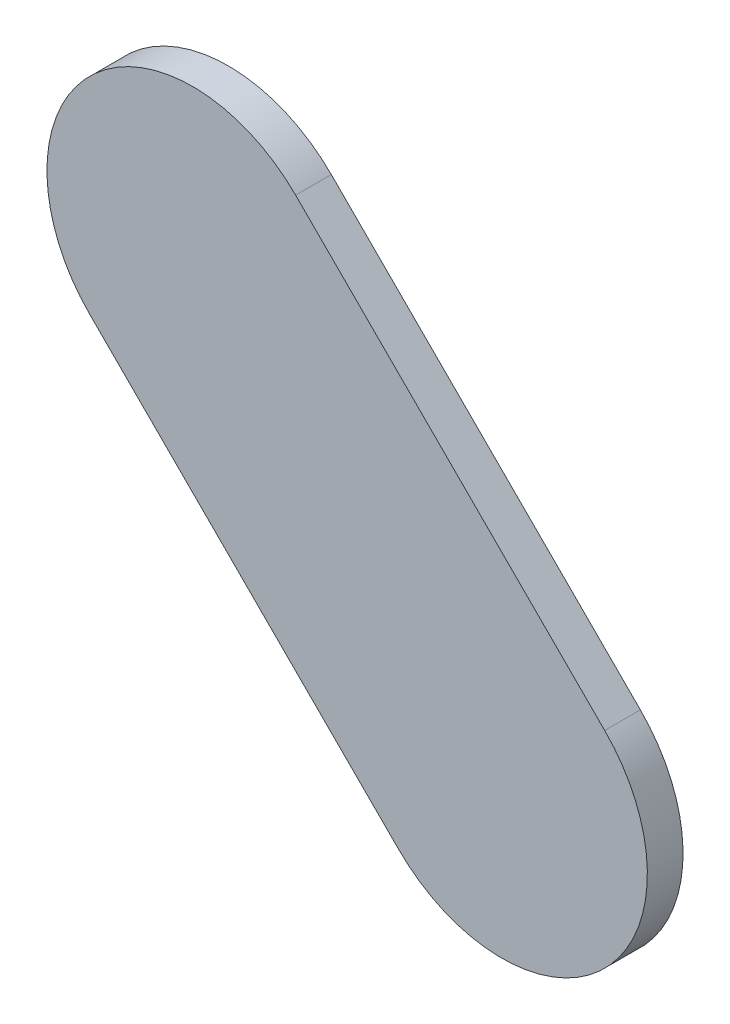
ISO-10303-21;
HEADER;
FILE_DESCRIPTION(('STEP AP214'),'2;1');
FILE_NAME('part.step','',(''),(''),'','','');
FILE_SCHEMA(('AUTOMOTIVE_DESIGN { 1 0 10303 214 1 1 1 1 }'));
ENDSEC;
DATA;
#1=APPLICATION_CONTEXT('core data for automotive mechanical design processes');
#2=APPLICATION_PROTOCOL_DEFINITION('international standard','automotive_design',2000,#1);
#3=PRODUCT_CONTEXT('',#1,'mechanical');
#4=PRODUCT('Part','Part','',(#3));
#5=PRODUCT_RELATED_PRODUCT_CATEGORY('part','',(#4));
#6=PRODUCT_DEFINITION_FORMATION('','',#4);
#7=PRODUCT_DEFINITION_CONTEXT('part definition',#1,'design');
#8=PRODUCT_DEFINITION('design','',#6,#7);
#9=PRODUCT_DEFINITION_SHAPE('','',#8);
#10=(LENGTH_UNIT() NAMED_UNIT(*) SI_UNIT(.MILLI.,.METRE.));
#11=(NAMED_UNIT(*) PLANE_ANGLE_UNIT() SI_UNIT($,.RADIAN.));
#12=(NAMED_UNIT(*) SI_UNIT($,.STERADIAN.) SOLID_ANGLE_UNIT());
#13=UNCERTAINTY_MEASURE_WITH_UNIT(LENGTH_MEASURE(1.E-05),#10,'distance_accuracy_value','');
#14=(GEOMETRIC_REPRESENTATION_CONTEXT(3) GLOBAL_UNCERTAINTY_ASSIGNED_CONTEXT((#13)) GLOBAL_UNIT_ASSIGNED_CONTEXT((#10,
#11,#12)) REPRESENTATION_CONTEXT('',''));
#15=CARTESIAN_POINT('',(0.,0.,0.));
#16=DIRECTION('',(0.,0.,1.));
#17=DIRECTION('',(1.,0.,0.));
#18=AXIS2_PLACEMENT_3D('',#15,#16,#17);
#19=CARTESIAN_POINT('',(4.079482332428,7.325038039131,0.79916));
#20=DIRECTION('',(0.,0.,1.));
#21=DIRECTION('',(1.,0.,0.));
#22=AXIS2_PLACEMENT_3D('',#19,#20,#21);
#23=PLANE('',#22);
#24=CARTESIAN_POINT('',(3.931096333,7.472904434268,0.79916));
#25=DIRECTION('',(0.,0.,1.));
#26=DIRECTION('',(1.,0.,0.));
#27=AXIS2_PLACEMENT_3D('',#24,#25,#26);
#28=CIRCLE('',#27,0.140000472348);
#29=CARTESIAN_POINT('',(3.83210122183356,7.3739094441665,0.79916));
#30=VERTEX_POINT('',#29);
#31=CARTESIAN_POINT('',(4.03009169726737,7.57189963673356,0.79916));
#32=VERTEX_POINT('',#31);
#33=EDGE_CURVE('E20',#30,#32,#28,.F.);
#34=ORIENTED_EDGE('',*,*,#33,.F.);
#35=DIRECTION('',(-0.707107575236102,0.707105987136102,0.));
#36=VECTOR('',#35,1.);
#37=CARTESIAN_POINT('',(4.129086333001,7.076925000001,0.79916));
#38=LINE('',#37,#36);
#39=CARTESIAN_POINT('',(4.12908641390159,7.07692491910059,0.79916));
#40=VERTEX_POINT('',#39);
#41=EDGE_CURVE('E65',#30,#40,#38,.F.);
#42=ORIENTED_EDGE('',*,*,#41,.T.);
#43=CARTESIAN_POINT('',(4.228081333,7.175919333,0.79916));
#44=DIRECTION('',(0.,0.,1.));
#45=DIRECTION('',(1.,0.,0.));
#46=AXIS2_PLACEMENT_3D('',#43,#44,#45);
#47=CIRCLE('',#46,0.140000072315);
#48=CARTESIAN_POINT('',(4.32707622233319,7.27491444466621,0.79916));
#49=VERTEX_POINT('',#48);
#50=EDGE_CURVE('E57',#49,#40,#47,.F.);
#51=ORIENTED_EDGE('',*,*,#50,.F.);
#52=DIRECTION('',(0.707105987136602,-0.707107575235602,0.));
#53=VECTOR('',#52,1.);
#54=CARTESIAN_POINT('',(4.030091667001,7.571899667,0.79916));
#55=LINE('',#54,#53);
#56=EDGE_CURVE('E64',#49,#32,#55,.F.);
#57=ORIENTED_EDGE('',*,*,#56,.T.);
#58=EDGE_LOOP('',(#34,#42,#51,#57));
#59=FACE_BOUND('',#58,.T.);
#60=ADVANCED_FACE('F17',(#59),#23,.T.);
#61=CARTESIAN_POINT('',(4.129086333001,7.076925000001,0.76487));
#62=DIRECTION('',(0.707105987136102,0.707107575236102,0.));
#63=DIRECTION('',(-0.707107575236102,0.707105987136102,0.));
#64=AXIS2_PLACEMENT_3D('',#61,#62,#63);
#65=PLANE('',#64);
#66=DIRECTION('',(0.,0.,1.));
#67=VECTOR('',#66,1.);
#68=CARTESIAN_POINT('',(3.83210133300002,7.37390933300002,0.76487));
#69=LINE('',#68,#67);
#70=CARTESIAN_POINT('',(3.83210122183344,7.37390944416632,0.76487));
#71=VERTEX_POINT('',#70);
#72=EDGE_CURVE('E68',#71,#30,#69,.T.);
#73=ORIENTED_EDGE('',*,*,#72,.F.);
#74=DIRECTION('',(-0.707107575236587,0.707105987135616,0.));
#75=VECTOR('',#74,1.);
#76=CARTESIAN_POINT('',(4.129086333001,7.076925000001,0.76487));
#77=LINE('',#76,#75);
#78=CARTESIAN_POINT('',(4.12908641390163,7.07692491910056,0.76487));
#79=VERTEX_POINT('',#78);
#80=EDGE_CURVE('E72',#79,#71,#77,.T.);
#81=ORIENTED_EDGE('',*,*,#80,.F.);
#82=DIRECTION('',(0.,0.,1.));
#83=VECTOR('',#82,1.);
#84=CARTESIAN_POINT('',(4.129086333001,7.076925000001,0.76487));
#85=LINE('',#84,#83);
#86=EDGE_CURVE('E60',#40,#79,#85,.F.);
#87=ORIENTED_EDGE('',*,*,#86,.F.);
#88=ORIENTED_EDGE('',*,*,#41,.F.);
#89=EDGE_LOOP('',(#73,#81,#87,#88));
#90=FACE_BOUND('',#89,.T.);
#91=ADVANCED_FACE('F70',(#90),#65,.F.);
#92=CARTESIAN_POINT('',(3.931096333,7.472904434268,0.76487));
#93=DIRECTION('',(0.,0.,1.));
#94=DIRECTION('',(1.,0.,0.));
#95=AXIS2_PLACEMENT_3D('',#92,#93,#94);
#96=CYLINDRICAL_SURFACE('',#95,0.140000472348);
#97=DIRECTION('',(0.,0.,1.));
#98=VECTOR('',#97,1.);
#99=CARTESIAN_POINT('',(4.030091667001,7.571899667,0.76487));
#100=LINE('',#99,#98);
#101=CARTESIAN_POINT('',(4.03009169726735,7.57189963673358,0.76487));
#102=VERTEX_POINT('',#101);
#103=EDGE_CURVE('E77',#32,#102,#100,.F.);
#104=ORIENTED_EDGE('',*,*,#103,.T.);
#105=CARTESIAN_POINT('',(3.931096,7.472904667,0.76487));
#106=DIRECTION('',(0.,0.,1.));
#107=DIRECTION('',(1.,0.,0.));
#108=AXIS2_PLACEMENT_3D('',#105,#106,#107);
#109=CIRCLE('',#108,0.140000072315);
#110=EDGE_CURVE('E26',#71,#102,#109,.F.);
#111=ORIENTED_EDGE('',*,*,#110,.F.);
#112=ORIENTED_EDGE('',*,*,#72,.T.);
#113=ORIENTED_EDGE('',*,*,#33,.T.);
#114=EDGE_LOOP('',(#104,#111,#112,#113));
#115=FACE_BOUND('',#114,.T.);
#116=ADVANCED_FACE('F88',(#115),#96,.T.);
#117=CARTESIAN_POINT('',(4.030091667001,7.571899667,0.76487));
#118=DIRECTION('',(-0.707107575235602,-0.707105987136602,0.));
#119=DIRECTION('',(0.707105987136602,-0.707107575235602,0.));
#120=AXIS2_PLACEMENT_3D('',#117,#118,#119);
#121=PLANE('',#120);
#122=DIRECTION('',(0.,0.,1.));
#123=VECTOR('',#122,1.);
#124=CARTESIAN_POINT('',(4.32707599999998,7.27491466699998,0.76487));
#125=LINE('',#124,#123);
#126=CARTESIAN_POINT('',(4.32707622233323,7.27491444466627,0.76487));
#127=VERTEX_POINT('',#126);
#128=EDGE_CURVE('E62',#127,#49,#125,.T.);
#129=ORIENTED_EDGE('',*,*,#128,.F.);
#130=DIRECTION('',(0.707105987136806,-0.707107575235397,0.));
#131=VECTOR('',#130,1.);
#132=CARTESIAN_POINT('',(4.030091667001,7.571899667,0.76487));
#133=LINE('',#132,#131);
#134=EDGE_CURVE('E11',#102,#127,#133,.T.);
#135=ORIENTED_EDGE('',*,*,#134,.F.);
#136=ORIENTED_EDGE('',*,*,#103,.F.);
#137=ORIENTED_EDGE('',*,*,#56,.F.);
#138=EDGE_LOOP('',(#129,#135,#136,#137));
#139=FACE_BOUND('',#138,.T.);
#140=ADVANCED_FACE('F96',(#139),#121,.F.);
#141=CARTESIAN_POINT('',(4.228081333,7.175919333,0.76487));
#142=DIRECTION('',(0.,0.,1.));
#143=DIRECTION('',(1.,0.,0.));
#144=AXIS2_PLACEMENT_3D('',#141,#142,#143);
#145=CYLINDRICAL_SURFACE('',#144,0.140000072315);
#146=CARTESIAN_POINT('',(4.228081333001,7.175919898733,0.76487));
#147=DIRECTION('',(0.,0.,1.));
#148=DIRECTION('',(1.,0.,0.));
#149=AXIS2_PLACEMENT_3D('',#146,#147,#148);
#150=CIRCLE('',#149,0.14);
#151=EDGE_CURVE('E35',#127,#79,#150,.F.);
#152=ORIENTED_EDGE('',*,*,#151,.F.);
#153=ORIENTED_EDGE('',*,*,#128,.T.);
#154=ORIENTED_EDGE('',*,*,#50,.T.);
#155=ORIENTED_EDGE('',*,*,#86,.T.);
#156=EDGE_LOOP('',(#152,#153,#154,#155));
#157=FACE_BOUND('',#156,.T.);
#158=ADVANCED_FACE('F58',(#157),#145,.T.);
#159=CARTESIAN_POINT('',(4.079482332428,7.325038039131,0.76487));
#160=DIRECTION('',(0.,0.,-1.));
#161=DIRECTION('',(-1.,0.,0.));
#162=AXIS2_PLACEMENT_3D('',#159,#160,#161);
#163=PLANE('',#162);
#164=ORIENTED_EDGE('',*,*,#134,.T.);
#165=ORIENTED_EDGE('',*,*,#151,.T.);
#166=ORIENTED_EDGE('',*,*,#80,.T.);
#167=ORIENTED_EDGE('',*,*,#110,.T.);
#168=EDGE_LOOP('',(#164,#165,#166,#167));
#169=FACE_BOUND('',#168,.T.);
#170=ADVANCED_FACE('F89',(#169),#163,.T.);
#171=CLOSED_SHELL('',(#60,#91,#116,#140,#158,#170));
#172=MANIFOLD_SOLID_BREP('B1',#171);
#173=ADVANCED_BREP_SHAPE_REPRESENTATION('',(#18,#172),#14);
#174=SHAPE_DEFINITION_REPRESENTATION(#9,#173);
ENDSEC;
END-ISO-10303-21;
